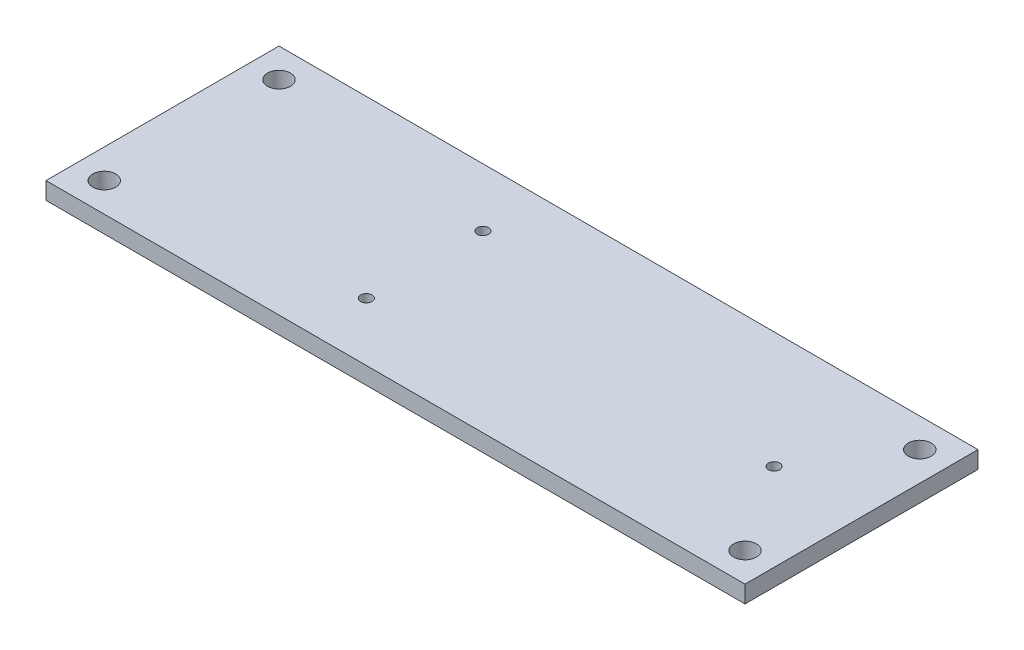
ISO-10303-21;
HEADER;
FILE_DESCRIPTION(('STEP AP214'),'2;1');
FILE_NAME('part.step','',(''),(''),'','','');
FILE_SCHEMA(('AUTOMOTIVE_DESIGN { 1 0 10303 214 1 1 1 1 }'));
ENDSEC;
DATA;
#1=APPLICATION_CONTEXT('core data for automotive mechanical design processes');
#2=APPLICATION_PROTOCOL_DEFINITION('international standard','automotive_design',2000,#1);
#3=PRODUCT_CONTEXT('',#1,'mechanical');
#4=PRODUCT('Part','Part','',(#3));
#5=PRODUCT_RELATED_PRODUCT_CATEGORY('part','',(#4));
#6=PRODUCT_DEFINITION_FORMATION('','',#4);
#7=PRODUCT_DEFINITION_CONTEXT('part definition',#1,'design');
#8=PRODUCT_DEFINITION('design','',#6,#7);
#9=PRODUCT_DEFINITION_SHAPE('','',#8);
#10=(LENGTH_UNIT() NAMED_UNIT(*) SI_UNIT(.MILLI.,.METRE.));
#11=(NAMED_UNIT(*) PLANE_ANGLE_UNIT() SI_UNIT($,.RADIAN.));
#12=(NAMED_UNIT(*) SI_UNIT($,.STERADIAN.) SOLID_ANGLE_UNIT());
#13=UNCERTAINTY_MEASURE_WITH_UNIT(LENGTH_MEASURE(1.E-05),#10,'distance_accuracy_value','');
#14=(GEOMETRIC_REPRESENTATION_CONTEXT(3) GLOBAL_UNCERTAINTY_ASSIGNED_CONTEXT((#13)) GLOBAL_UNIT_ASSIGNED_CONTEXT((#10,
#11,#12)) REPRESENTATION_CONTEXT('',''));
#15=CARTESIAN_POINT('',(0.,0.,0.));
#16=DIRECTION('',(0.,0.,1.));
#17=DIRECTION('',(1.,0.,0.));
#18=AXIS2_PLACEMENT_3D('',#15,#16,#17);
#19=CARTESIAN_POINT('',(0.,1.5,0.));
#20=DIRECTION('',(0.,-1.,0.));
#21=DIRECTION('',(0.,0.,-1.));
#22=AXIS2_PLACEMENT_3D('',#19,#20,#21);
#23=PLANE('',#22);
#24=CARTESIAN_POINT('',(53.34,1.5,-10.16));
#25=DIRECTION('',(0.,1.,0.));
#26=DIRECTION('',(0.,0.,1.));
#27=AXIS2_PLACEMENT_3D('',#24,#25,#26);
#28=CIRCLE('',#27,0.499999999999999);
#29=CARTESIAN_POINT('',(53.34,1.5,-9.66));
#30=VERTEX_POINT('',#29);
#31=EDGE_CURVE('E139',#30,#30,#28,.T.);
#32=ORIENTED_EDGE('',*,*,#31,.F.);
#33=EDGE_LOOP('',(#32));
#34=FACE_BOUND('',#33,.T.);
#35=CARTESIAN_POINT('',(2.54,1.5,-17.78));
#36=DIRECTION('',(0.,1.,0.));
#37=DIRECTION('',(0.,0.,-1.));
#38=AXIS2_PLACEMENT_3D('',#35,#36,#37);
#39=CIRCLE('',#38,0.999999999999999);
#40=CARTESIAN_POINT('',(2.54,1.5,-18.78));
#41=VERTEX_POINT('',#40);
#42=EDGE_CURVE('E127',#41,#41,#39,.T.);
#43=ORIENTED_EDGE('',*,*,#42,.F.);
#44=EDGE_LOOP('',(#43));
#45=FACE_BOUND('',#44,.T.);
#46=CARTESIAN_POINT('',(58.42,1.5,-2.54));
#47=DIRECTION('',(0.,1.,0.));
#48=DIRECTION('',(0.,0.,-1.));
#49=AXIS2_PLACEMENT_3D('',#46,#47,#48);
#50=CIRCLE('',#49,0.999999999999998);
#51=CARTESIAN_POINT('',(58.42,1.5,-3.54));
#52=VERTEX_POINT('',#51);
#53=EDGE_CURVE('E115',#52,#52,#50,.T.);
#54=ORIENTED_EDGE('',*,*,#53,.F.);
#55=EDGE_LOOP('',(#54));
#56=FACE_BOUND('',#55,.T.);
#57=DIRECTION('',(0.,0.,1.));
#58=VECTOR('',#57,1.);
#59=CARTESIAN_POINT('',(0.,1.5,0.));
#60=LINE('',#59,#58);
#61=CARTESIAN_POINT('',(0.,1.5,-20.32));
#62=VERTEX_POINT('',#61);
#63=CARTESIAN_POINT('',(0.,1.5,0.));
#64=VERTEX_POINT('',#63);
#65=EDGE_CURVE('E85',#62,#64,#60,.T.);
#66=ORIENTED_EDGE('',*,*,#65,.T.);
#67=DIRECTION('',(1.,0.,0.));
#68=VECTOR('',#67,1.);
#69=CARTESIAN_POINT('',(0.,1.5,0.));
#70=LINE('',#69,#68);
#71=CARTESIAN_POINT('',(60.96,1.5,0.));
#72=VERTEX_POINT('',#71);
#73=EDGE_CURVE('E80',#64,#72,#70,.T.);
#74=ORIENTED_EDGE('',*,*,#73,.T.);
#75=DIRECTION('',(0.,0.,-1.));
#76=VECTOR('',#75,1.);
#77=CARTESIAN_POINT('',(60.96,1.5,0.));
#78=LINE('',#77,#76);
#79=CARTESIAN_POINT('',(60.96,1.5,-20.32));
#80=VERTEX_POINT('',#79);
#81=EDGE_CURVE('E83',#72,#80,#78,.T.);
#82=ORIENTED_EDGE('',*,*,#81,.T.);
#83=DIRECTION('',(-1.,0.,0.));
#84=VECTOR('',#83,1.);
#85=CARTESIAN_POINT('',(0.,1.5,-20.32));
#86=LINE('',#85,#84);
#87=EDGE_CURVE('E50',#80,#62,#86,.T.);
#88=ORIENTED_EDGE('',*,*,#87,.T.);
#89=EDGE_LOOP('',(#66,#74,#82,#88));
#90=FACE_BOUND('',#89,.T.);
#91=CARTESIAN_POINT('',(2.54,1.5,-2.54));
#92=DIRECTION('',(0.,1.,0.));
#93=DIRECTION('',(0.,0.,1.));
#94=AXIS2_PLACEMENT_3D('',#91,#92,#93);
#95=CIRCLE('',#94,1.);
#96=CARTESIAN_POINT('',(2.54,1.5,-1.54));
#97=VERTEX_POINT('',#96);
#98=EDGE_CURVE('E100',#97,#97,#95,.T.);
#99=ORIENTED_EDGE('',*,*,#98,.F.);
#100=EDGE_LOOP('',(#99));
#101=FACE_BOUND('',#100,.T.);
#102=CARTESIAN_POINT('',(58.42,1.5,-17.78));
#103=DIRECTION('',(0.,1.,0.));
#104=DIRECTION('',(0.,0.,1.));
#105=AXIS2_PLACEMENT_3D('',#102,#103,#104);
#106=CIRCLE('',#105,0.999999999999997);
#107=CARTESIAN_POINT('',(58.42,1.5,-16.78));
#108=VERTEX_POINT('',#107);
#109=EDGE_CURVE('E121',#108,#108,#106,.T.);
#110=ORIENTED_EDGE('',*,*,#109,.F.);
#111=EDGE_LOOP('',(#110));
#112=FACE_BOUND('',#111,.T.);
#113=CARTESIAN_POINT('',(22.86,1.5,-5.08));
#114=DIRECTION('',(0.,1.,0.));
#115=DIRECTION('',(0.,0.,1.));
#116=AXIS2_PLACEMENT_3D('',#113,#114,#115);
#117=CIRCLE('',#116,0.499999999999999);
#118=CARTESIAN_POINT('',(22.86,1.5,-4.58));
#119=VERTEX_POINT('',#118);
#120=EDGE_CURVE('E133',#119,#119,#117,.T.);
#121=ORIENTED_EDGE('',*,*,#120,.F.);
#122=EDGE_LOOP('',(#121));
#123=FACE_BOUND('',#122,.T.);
#124=CARTESIAN_POINT('',(22.86,1.5,-15.24));
#125=DIRECTION('',(0.,1.,0.));
#126=DIRECTION('',(0.,0.,-1.));
#127=AXIS2_PLACEMENT_3D('',#124,#125,#126);
#128=CIRCLE('',#127,0.499999999999999);
#129=CARTESIAN_POINT('',(22.86,1.5,-15.74));
#130=VERTEX_POINT('',#129);
#131=EDGE_CURVE('E145',#130,#130,#128,.T.);
#132=ORIENTED_EDGE('',*,*,#131,.F.);
#133=EDGE_LOOP('',(#132));
#134=FACE_BOUND('',#133,.T.);
#135=ADVANCED_FACE('F33',(#34,#45,#56,#90,#101,#112,#123,#134),#23,.F.);
#136=CARTESIAN_POINT('',(0.,0.,0.));
#137=DIRECTION('',(0.,-1.,0.));
#138=DIRECTION('',(0.,0.,-1.));
#139=AXIS2_PLACEMENT_3D('',#136,#137,#138);
#140=PLANE('',#139);
#141=CARTESIAN_POINT('',(53.34,0.,-10.16));
#142=DIRECTION('',(0.,1.,0.));
#143=DIRECTION('',(0.,0.,1.));
#144=AXIS2_PLACEMENT_3D('',#141,#142,#143);
#145=CIRCLE('',#144,0.499999999999999);
#146=CARTESIAN_POINT('',(53.34,0.,-9.66));
#147=VERTEX_POINT('',#146);
#148=EDGE_CURVE('E142',#147,#147,#145,.T.);
#149=ORIENTED_EDGE('',*,*,#148,.T.);
#150=EDGE_LOOP('',(#149));
#151=FACE_BOUND('',#150,.T.);
#152=CARTESIAN_POINT('',(2.54,0.,-17.78));
#153=DIRECTION('',(0.,1.,0.));
#154=DIRECTION('',(0.,0.,-1.));
#155=AXIS2_PLACEMENT_3D('',#152,#153,#154);
#156=CIRCLE('',#155,0.999999999999999);
#157=CARTESIAN_POINT('',(2.54,0.,-18.78));
#158=VERTEX_POINT('',#157);
#159=EDGE_CURVE('E130',#158,#158,#156,.T.);
#160=ORIENTED_EDGE('',*,*,#159,.T.);
#161=EDGE_LOOP('',(#160));
#162=FACE_BOUND('',#161,.T.);
#163=CARTESIAN_POINT('',(58.42,0.,-2.54));
#164=DIRECTION('',(0.,1.,0.));
#165=DIRECTION('',(0.,0.,-1.));
#166=AXIS2_PLACEMENT_3D('',#163,#164,#165);
#167=CIRCLE('',#166,0.999999999999998);
#168=CARTESIAN_POINT('',(58.42,0.,-3.54));
#169=VERTEX_POINT('',#168);
#170=EDGE_CURVE('E118',#169,#169,#167,.T.);
#171=ORIENTED_EDGE('',*,*,#170,.T.);
#172=EDGE_LOOP('',(#171));
#173=FACE_BOUND('',#172,.T.);
#174=DIRECTION('',(0.,0.,1.));
#175=VECTOR('',#174,1.);
#176=CARTESIAN_POINT('',(0.,0.,0.));
#177=LINE('',#176,#175);
#178=CARTESIAN_POINT('',(0.,0.,-20.32));
#179=VERTEX_POINT('',#178);
#180=CARTESIAN_POINT('',(0.,0.,0.));
#181=VERTEX_POINT('',#180);
#182=EDGE_CURVE('E97',#179,#181,#177,.T.);
#183=ORIENTED_EDGE('',*,*,#182,.F.);
#184=DIRECTION('',(-1.,0.,0.));
#185=VECTOR('',#184,1.);
#186=CARTESIAN_POINT('',(0.,0.,-20.32));
#187=LINE('',#186,#185);
#188=CARTESIAN_POINT('',(60.96,0.,-20.32));
#189=VERTEX_POINT('',#188);
#190=EDGE_CURVE('E73',#189,#179,#187,.T.);
#191=ORIENTED_EDGE('',*,*,#190,.F.);
#192=DIRECTION('',(0.,0.,-1.));
#193=VECTOR('',#192,1.);
#194=CARTESIAN_POINT('',(60.96,0.,0.));
#195=LINE('',#194,#193);
#196=CARTESIAN_POINT('',(60.96,0.,0.));
#197=VERTEX_POINT('',#196);
#198=EDGE_CURVE('E67',#197,#189,#195,.T.);
#199=ORIENTED_EDGE('',*,*,#198,.F.);
#200=DIRECTION('',(1.,0.,0.));
#201=VECTOR('',#200,1.);
#202=CARTESIAN_POINT('',(0.,0.,0.));
#203=LINE('',#202,#201);
#204=EDGE_CURVE('E89',#181,#197,#203,.T.);
#205=ORIENTED_EDGE('',*,*,#204,.F.);
#206=EDGE_LOOP('',(#183,#191,#199,#205));
#207=FACE_BOUND('',#206,.T.);
#208=CARTESIAN_POINT('',(2.54,0.,-2.54));
#209=DIRECTION('',(0.,1.,0.));
#210=DIRECTION('',(0.,0.,1.));
#211=AXIS2_PLACEMENT_3D('',#208,#209,#210);
#212=CIRCLE('',#211,1.);
#213=CARTESIAN_POINT('',(2.54,0.,-1.54));
#214=VERTEX_POINT('',#213);
#215=EDGE_CURVE('E112',#214,#214,#212,.T.);
#216=ORIENTED_EDGE('',*,*,#215,.T.);
#217=EDGE_LOOP('',(#216));
#218=FACE_BOUND('',#217,.T.);
#219=CARTESIAN_POINT('',(58.42,0.,-17.78));
#220=DIRECTION('',(0.,1.,0.));
#221=DIRECTION('',(0.,0.,1.));
#222=AXIS2_PLACEMENT_3D('',#219,#220,#221);
#223=CIRCLE('',#222,0.999999999999997);
#224=CARTESIAN_POINT('',(58.42,0.,-16.78));
#225=VERTEX_POINT('',#224);
#226=EDGE_CURVE('E124',#225,#225,#223,.T.);
#227=ORIENTED_EDGE('',*,*,#226,.T.);
#228=EDGE_LOOP('',(#227));
#229=FACE_BOUND('',#228,.T.);
#230=CARTESIAN_POINT('',(22.86,0.,-5.08));
#231=DIRECTION('',(0.,1.,0.));
#232=DIRECTION('',(0.,0.,1.));
#233=AXIS2_PLACEMENT_3D('',#230,#231,#232);
#234=CIRCLE('',#233,0.499999999999999);
#235=CARTESIAN_POINT('',(22.86,0.,-4.58));
#236=VERTEX_POINT('',#235);
#237=EDGE_CURVE('E136',#236,#236,#234,.T.);
#238=ORIENTED_EDGE('',*,*,#237,.T.);
#239=EDGE_LOOP('',(#238));
#240=FACE_BOUND('',#239,.T.);
#241=CARTESIAN_POINT('',(22.86,0.,-15.24));
#242=DIRECTION('',(0.,1.,0.));
#243=DIRECTION('',(0.,0.,-1.));
#244=AXIS2_PLACEMENT_3D('',#241,#242,#243);
#245=CIRCLE('',#244,0.499999999999999);
#246=CARTESIAN_POINT('',(22.86,0.,-15.74));
#247=VERTEX_POINT('',#246);
#248=EDGE_CURVE('E148',#247,#247,#245,.T.);
#249=ORIENTED_EDGE('',*,*,#248,.T.);
#250=EDGE_LOOP('',(#249));
#251=FACE_BOUND('',#250,.T.);
#252=ADVANCED_FACE('F108',(#151,#162,#173,#207,#218,#229,#240,#251),#140,.T.);
#253=CARTESIAN_POINT('',(0.,1.5,0.));
#254=DIRECTION('',(1.,0.,0.));
#255=DIRECTION('',(0.,0.,-1.));
#256=AXIS2_PLACEMENT_3D('',#253,#254,#255);
#257=PLANE('',#256);
#258=ORIENTED_EDGE('',*,*,#182,.T.);
#259=DIRECTION('',(0.,-1.,0.));
#260=VECTOR('',#259,1.);
#261=CARTESIAN_POINT('',(0.,1.5,0.));
#262=LINE('',#261,#260);
#263=EDGE_CURVE('E11',#64,#181,#262,.T.);
#264=ORIENTED_EDGE('',*,*,#263,.F.);
#265=ORIENTED_EDGE('',*,*,#65,.F.);
#266=DIRECTION('',(0.,-1.,0.));
#267=VECTOR('',#266,1.);
#268=CARTESIAN_POINT('',(0.,1.5,-20.32));
#269=LINE('',#268,#267);
#270=EDGE_CURVE('E93',#62,#179,#269,.T.);
#271=ORIENTED_EDGE('',*,*,#270,.T.);
#272=EDGE_LOOP('',(#258,#264,#265,#271));
#273=FACE_BOUND('',#272,.T.);
#274=ADVANCED_FACE('F35',(#273),#257,.F.);
#275=CARTESIAN_POINT('',(0.,1.5,0.));
#276=DIRECTION('',(0.,0.,-1.));
#277=DIRECTION('',(-1.,0.,0.));
#278=AXIS2_PLACEMENT_3D('',#275,#276,#277);
#279=PLANE('',#278);
#280=ORIENTED_EDGE('',*,*,#204,.T.);
#281=DIRECTION('',(0.,-1.,0.));
#282=VECTOR('',#281,1.);
#283=CARTESIAN_POINT('',(60.96,1.5,0.));
#284=LINE('',#283,#282);
#285=EDGE_CURVE('E42',#72,#197,#284,.T.);
#286=ORIENTED_EDGE('',*,*,#285,.F.);
#287=ORIENTED_EDGE('',*,*,#73,.F.);
#288=ORIENTED_EDGE('',*,*,#263,.T.);
#289=EDGE_LOOP('',(#280,#286,#287,#288));
#290=FACE_BOUND('',#289,.T.);
#291=ADVANCED_FACE('F88',(#290),#279,.F.);
#292=CARTESIAN_POINT('',(60.96,1.5,0.));
#293=DIRECTION('',(-1.,0.,0.));
#294=DIRECTION('',(0.,0.,1.));
#295=AXIS2_PLACEMENT_3D('',#292,#293,#294);
#296=PLANE('',#295);
#297=ORIENTED_EDGE('',*,*,#198,.T.);
#298=DIRECTION('',(0.,-1.,0.));
#299=VECTOR('',#298,1.);
#300=CARTESIAN_POINT('',(60.96,1.5,-20.32));
#301=LINE('',#300,#299);
#302=EDGE_CURVE('E90',#80,#189,#301,.T.);
#303=ORIENTED_EDGE('',*,*,#302,.F.);
#304=ORIENTED_EDGE('',*,*,#81,.F.);
#305=ORIENTED_EDGE('',*,*,#285,.T.);
#306=EDGE_LOOP('',(#297,#303,#304,#305));
#307=FACE_BOUND('',#306,.T.);
#308=ADVANCED_FACE('F91',(#307),#296,.F.);
#309=CARTESIAN_POINT('',(0.,1.5,-20.32));
#310=DIRECTION('',(0.,0.,1.));
#311=DIRECTION('',(1.,0.,0.));
#312=AXIS2_PLACEMENT_3D('',#309,#310,#311);
#313=PLANE('',#312);
#314=ORIENTED_EDGE('',*,*,#190,.T.);
#315=ORIENTED_EDGE('',*,*,#270,.F.);
#316=ORIENTED_EDGE('',*,*,#87,.F.);
#317=ORIENTED_EDGE('',*,*,#302,.T.);
#318=EDGE_LOOP('',(#314,#315,#316,#317));
#319=FACE_BOUND('',#318,.T.);
#320=ADVANCED_FACE('F105',(#319),#313,.F.);
#321=CARTESIAN_POINT('',(2.54,1.5,-2.54));
#322=DIRECTION('',(0.,-1.,0.));
#323=DIRECTION('',(0.,0.,-1.));
#324=AXIS2_PLACEMENT_3D('',#321,#322,#323);
#325=CYLINDRICAL_SURFACE('',#324,1.);
#326=ORIENTED_EDGE('',*,*,#98,.T.);
#327=EDGE_LOOP('',(#326));
#328=FACE_BOUND('',#327,.T.);
#329=ORIENTED_EDGE('',*,*,#215,.F.);
#330=EDGE_LOOP('',(#329));
#331=FACE_BOUND('',#330,.T.);
#332=ADVANCED_FACE('F168',(#328,#331),#325,.F.);
#333=CARTESIAN_POINT('',(58.42,1.5,-2.54));
#334=DIRECTION('',(0.,-1.,0.));
#335=DIRECTION('',(0.,0.,-1.));
#336=AXIS2_PLACEMENT_3D('',#333,#334,#335);
#337=CYLINDRICAL_SURFACE('',#336,0.999999999999998);
#338=ORIENTED_EDGE('',*,*,#53,.T.);
#339=EDGE_LOOP('',(#338));
#340=FACE_BOUND('',#339,.T.);
#341=ORIENTED_EDGE('',*,*,#170,.F.);
#342=EDGE_LOOP('',(#341));
#343=FACE_BOUND('',#342,.T.);
#344=ADVANCED_FACE('F214',(#340,#343),#337,.F.);
#345=CARTESIAN_POINT('',(58.42,1.5,-17.78));
#346=DIRECTION('',(0.,-1.,0.));
#347=DIRECTION('',(0.,0.,-1.));
#348=AXIS2_PLACEMENT_3D('',#345,#346,#347);
#349=CYLINDRICAL_SURFACE('',#348,0.999999999999997);
#350=ORIENTED_EDGE('',*,*,#109,.T.);
#351=EDGE_LOOP('',(#350));
#352=FACE_BOUND('',#351,.T.);
#353=ORIENTED_EDGE('',*,*,#226,.F.);
#354=EDGE_LOOP('',(#353));
#355=FACE_BOUND('',#354,.T.);
#356=ADVANCED_FACE('F222',(#352,#355),#349,.F.);
#357=CARTESIAN_POINT('',(2.54,1.5,-17.78));
#358=DIRECTION('',(0.,-1.,0.));
#359=DIRECTION('',(0.,0.,-1.));
#360=AXIS2_PLACEMENT_3D('',#357,#358,#359);
#361=CYLINDRICAL_SURFACE('',#360,0.999999999999999);
#362=ORIENTED_EDGE('',*,*,#42,.T.);
#363=EDGE_LOOP('',(#362));
#364=FACE_BOUND('',#363,.T.);
#365=ORIENTED_EDGE('',*,*,#159,.F.);
#366=EDGE_LOOP('',(#365));
#367=FACE_BOUND('',#366,.T.);
#368=ADVANCED_FACE('F230',(#364,#367),#361,.F.);
#369=CARTESIAN_POINT('',(22.86,1.5,-5.08));
#370=DIRECTION('',(0.,-1.,0.));
#371=DIRECTION('',(0.,0.,-1.));
#372=AXIS2_PLACEMENT_3D('',#369,#370,#371);
#373=CYLINDRICAL_SURFACE('',#372,0.499999999999999);
#374=ORIENTED_EDGE('',*,*,#120,.T.);
#375=EDGE_LOOP('',(#374));
#376=FACE_BOUND('',#375,.T.);
#377=ORIENTED_EDGE('',*,*,#237,.F.);
#378=EDGE_LOOP('',(#377));
#379=FACE_BOUND('',#378,.T.);
#380=ADVANCED_FACE('F239',(#376,#379),#373,.F.);
#381=CARTESIAN_POINT('',(53.34,1.5,-10.16));
#382=DIRECTION('',(0.,-1.,0.));
#383=DIRECTION('',(0.,0.,-1.));
#384=AXIS2_PLACEMENT_3D('',#381,#382,#383);
#385=CYLINDRICAL_SURFACE('',#384,0.499999999999999);
#386=ORIENTED_EDGE('',*,*,#31,.T.);
#387=EDGE_LOOP('',(#386));
#388=FACE_BOUND('',#387,.T.);
#389=ORIENTED_EDGE('',*,*,#148,.F.);
#390=EDGE_LOOP('',(#389));
#391=FACE_BOUND('',#390,.T.);
#392=ADVANCED_FACE('F248',(#388,#391),#385,.F.);
#393=CARTESIAN_POINT('',(22.86,1.5,-15.24));
#394=DIRECTION('',(0.,-1.,0.));
#395=DIRECTION('',(0.,0.,-1.));
#396=AXIS2_PLACEMENT_3D('',#393,#394,#395);
#397=CYLINDRICAL_SURFACE('',#396,0.499999999999999);
#398=ORIENTED_EDGE('',*,*,#131,.T.);
#399=EDGE_LOOP('',(#398));
#400=FACE_BOUND('',#399,.T.);
#401=ORIENTED_EDGE('',*,*,#248,.F.);
#402=EDGE_LOOP('',(#401));
#403=FACE_BOUND('',#402,.T.);
#404=ADVANCED_FACE('F154',(#400,#403),#397,.F.);
#405=CLOSED_SHELL('',(#135,#252,#274,#291,#308,#320,#332,#344,#356,#368,#380,#392,#404));
#406=MANIFOLD_SOLID_BREP('B2',#405);
#407=ADVANCED_BREP_SHAPE_REPRESENTATION('',(#18,#406),#14);
#408=SHAPE_DEFINITION_REPRESENTATION(#9,#407);
ENDSEC;
END-ISO-10303-21;
